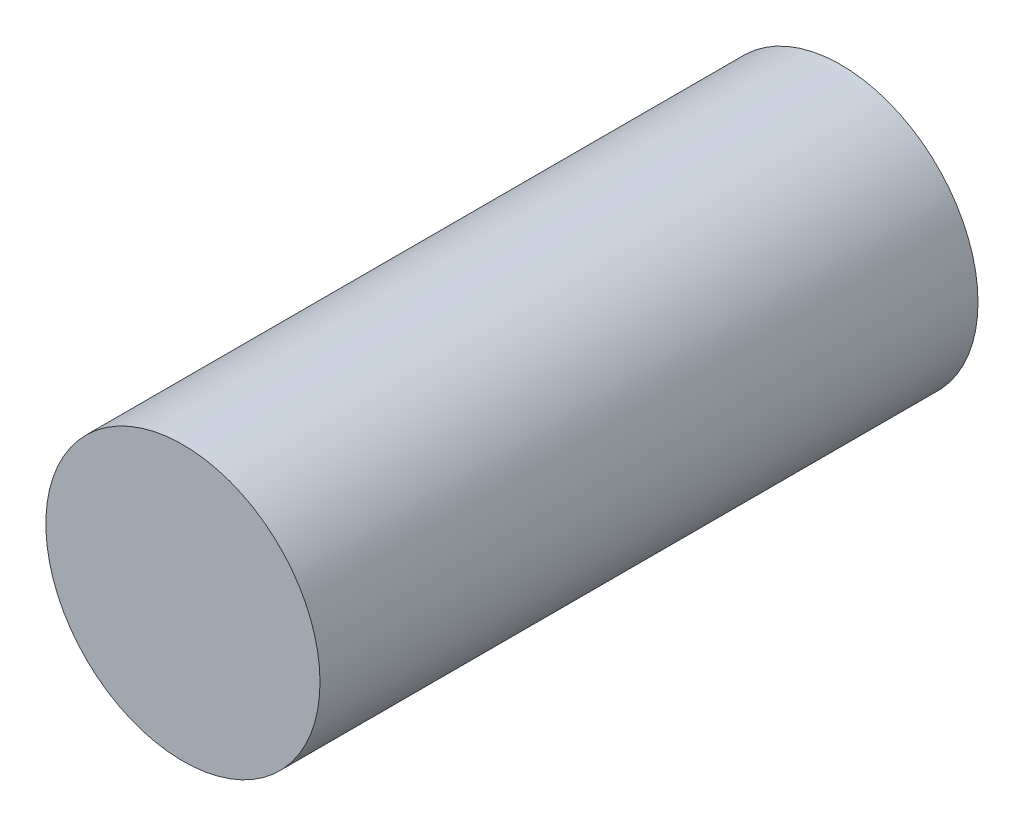
ISO-10303-21;
HEADER;
FILE_DESCRIPTION(('STEP AP214'),'2;1');
FILE_NAME('part.step','',(''),(''),'','','');
FILE_SCHEMA(('AUTOMOTIVE_DESIGN { 1 0 10303 214 1 1 1 1 }'));
ENDSEC;
DATA;
#1=APPLICATION_CONTEXT('core data for automotive mechanical design processes');
#2=APPLICATION_PROTOCOL_DEFINITION('international standard','automotive_design',2000,#1);
#3=PRODUCT_CONTEXT('',#1,'mechanical');
#4=PRODUCT('Part','Part','',(#3));
#5=PRODUCT_RELATED_PRODUCT_CATEGORY('part','',(#4));
#6=PRODUCT_DEFINITION_FORMATION('','',#4);
#7=PRODUCT_DEFINITION_CONTEXT('part definition',#1,'design');
#8=PRODUCT_DEFINITION('design','',#6,#7);
#9=PRODUCT_DEFINITION_SHAPE('','',#8);
#10=(LENGTH_UNIT() NAMED_UNIT(*) SI_UNIT(.MILLI.,.METRE.));
#11=(NAMED_UNIT(*) PLANE_ANGLE_UNIT() SI_UNIT($,.RADIAN.));
#12=(NAMED_UNIT(*) SI_UNIT($,.STERADIAN.) SOLID_ANGLE_UNIT());
#13=UNCERTAINTY_MEASURE_WITH_UNIT(LENGTH_MEASURE(1.E-05),#10,'distance_accuracy_value','');
#14=(GEOMETRIC_REPRESENTATION_CONTEXT(3) GLOBAL_UNCERTAINTY_ASSIGNED_CONTEXT((#13)) GLOBAL_UNIT_ASSIGNED_CONTEXT((#10,
#11,#12)) REPRESENTATION_CONTEXT('',''));
#15=CARTESIAN_POINT('',(0.,0.,0.));
#16=DIRECTION('',(0.,0.,1.));
#17=DIRECTION('',(1.,0.,0.));
#18=AXIS2_PLACEMENT_3D('',#15,#16,#17);
#19=CARTESIAN_POINT('',(0.,0.,60.));
#20=DIRECTION('',(0.,0.,-1.));
#21=DIRECTION('',(-1.,0.,0.));
#22=AXIS2_PLACEMENT_3D('',#19,#20,#21);
#23=CYLINDRICAL_SURFACE('',#22,12.5);
#24=CARTESIAN_POINT('',(0.,0.,60.));
#25=DIRECTION('',(0.,0.,1.));
#26=DIRECTION('',(1.,0.,0.));
#27=AXIS2_PLACEMENT_3D('',#24,#25,#26);
#28=CIRCLE('',#27,12.5);
#29=CARTESIAN_POINT('',(12.5,0.,60.));
#30=VERTEX_POINT('',#29);
#31=EDGE_CURVE('E10',#30,#30,#28,.T.);
#32=ORIENTED_EDGE('',*,*,#31,.F.);
#33=EDGE_LOOP('',(#32));
#34=FACE_BOUND('',#33,.T.);
#35=CARTESIAN_POINT('',(0.,0.,0.));
#36=DIRECTION('',(0.,0.,1.));
#37=DIRECTION('',(1.,0.,0.));
#38=AXIS2_PLACEMENT_3D('',#35,#36,#37);
#39=CIRCLE('',#38,12.5);
#40=CARTESIAN_POINT('',(12.5,0.,0.));
#41=VERTEX_POINT('',#40);
#42=EDGE_CURVE('E33',#41,#41,#39,.T.);
#43=ORIENTED_EDGE('',*,*,#42,.T.);
#44=EDGE_LOOP('',(#43));
#45=FACE_BOUND('',#44,.T.);
#46=ADVANCED_FACE('F30',(#34,#45),#23,.T.);
#47=CARTESIAN_POINT('',(0.,0.,60.));
#48=DIRECTION('',(0.,0.,1.));
#49=DIRECTION('',(1.,0.,0.));
#50=AXIS2_PLACEMENT_3D('',#47,#48,#49);
#51=PLANE('',#50);
#52=ORIENTED_EDGE('',*,*,#31,.T.);
#53=EDGE_LOOP('',(#52));
#54=FACE_BOUND('',#53,.T.);
#55=ADVANCED_FACE('F45',(#54),#51,.T.);
#56=CARTESIAN_POINT('',(0.,0.,0.));
#57=DIRECTION('',(0.,0.,1.));
#58=DIRECTION('',(1.,0.,0.));
#59=AXIS2_PLACEMENT_3D('',#56,#57,#58);
#60=PLANE('',#59);
#61=ORIENTED_EDGE('',*,*,#42,.F.);
#62=EDGE_LOOP('',(#61));
#63=FACE_BOUND('',#62,.T.);
#64=ADVANCED_FACE('F43',(#63),#60,.F.);
#65=CLOSED_SHELL('',(#46,#55,#64));
#66=MANIFOLD_SOLID_BREP('B2',#65);
#67=ADVANCED_BREP_SHAPE_REPRESENTATION('',(#18,#66),#14);
#68=SHAPE_DEFINITION_REPRESENTATION(#9,#67);
ENDSEC;
END-ISO-10303-21;
